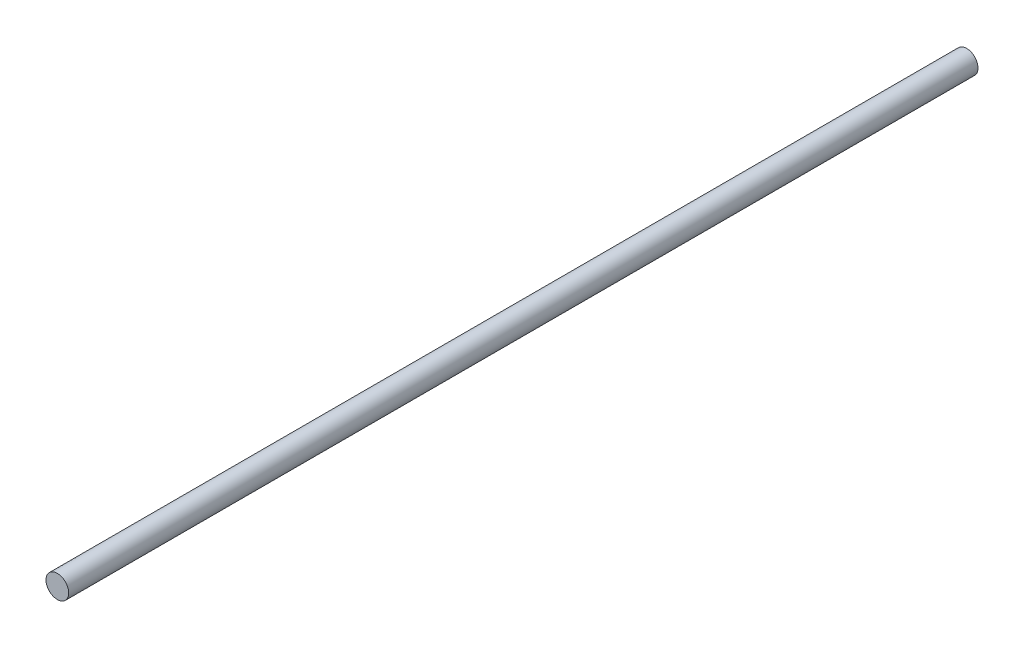
ISO-10303-21;
HEADER;
FILE_DESCRIPTION(('STEP AP214'),'2;1');
FILE_NAME('part.step','',(''),(''),'','','');
FILE_SCHEMA(('AUTOMOTIVE_DESIGN { 1 0 10303 214 1 1 1 1 }'));
ENDSEC;
DATA;
#1=APPLICATION_CONTEXT('core data for automotive mechanical design processes');
#2=APPLICATION_PROTOCOL_DEFINITION('international standard','automotive_design',2000,#1);
#3=PRODUCT_CONTEXT('',#1,'mechanical');
#4=PRODUCT('Part','Part','',(#3));
#5=PRODUCT_RELATED_PRODUCT_CATEGORY('part','',(#4));
#6=PRODUCT_DEFINITION_FORMATION('','',#4);
#7=PRODUCT_DEFINITION_CONTEXT('part definition',#1,'design');
#8=PRODUCT_DEFINITION('design','',#6,#7);
#9=PRODUCT_DEFINITION_SHAPE('','',#8);
#10=(LENGTH_UNIT() NAMED_UNIT(*) SI_UNIT(.MILLI.,.METRE.));
#11=(NAMED_UNIT(*) PLANE_ANGLE_UNIT() SI_UNIT($,.RADIAN.));
#12=(NAMED_UNIT(*) SI_UNIT($,.STERADIAN.) SOLID_ANGLE_UNIT());
#13=UNCERTAINTY_MEASURE_WITH_UNIT(LENGTH_MEASURE(1.E-05),#10,'distance_accuracy_value','');
#14=(GEOMETRIC_REPRESENTATION_CONTEXT(3) GLOBAL_UNCERTAINTY_ASSIGNED_CONTEXT((#13)) GLOBAL_UNIT_ASSIGNED_CONTEXT((#10,
#11,#12)) REPRESENTATION_CONTEXT('',''));
#15=CARTESIAN_POINT('',(0.,0.,0.));
#16=DIRECTION('',(0.,0.,1.));
#17=DIRECTION('',(1.,0.,0.));
#18=AXIS2_PLACEMENT_3D('',#15,#16,#17);
#19=CARTESIAN_POINT('',(0.,0.,254.));
#20=DIRECTION('',(0.,0.,-1.));
#21=DIRECTION('',(-1.,0.,0.));
#22=AXIS2_PLACEMENT_3D('',#19,#20,#21);
#23=CYLINDRICAL_SURFACE('',#22,3.175);
#24=CARTESIAN_POINT('',(0.,0.,254.));
#25=DIRECTION('',(0.,0.,1.));
#26=DIRECTION('',(1.,0.,0.));
#27=AXIS2_PLACEMENT_3D('',#24,#25,#26);
#28=CIRCLE('',#27,3.175);
#29=CARTESIAN_POINT('',(3.175,0.,254.));
#30=VERTEX_POINT('',#29);
#31=EDGE_CURVE('E10',#30,#30,#28,.T.);
#32=ORIENTED_EDGE('',*,*,#31,.F.);
#33=EDGE_LOOP('',(#32));
#34=FACE_BOUND('',#33,.T.);
#35=CARTESIAN_POINT('',(0.,0.,0.));
#36=DIRECTION('',(0.,0.,1.));
#37=DIRECTION('',(1.,0.,0.));
#38=AXIS2_PLACEMENT_3D('',#35,#36,#37);
#39=CIRCLE('',#38,3.175);
#40=CARTESIAN_POINT('',(3.175,0.,0.));
#41=VERTEX_POINT('',#40);
#42=EDGE_CURVE('E35',#41,#41,#39,.T.);
#43=ORIENTED_EDGE('',*,*,#42,.T.);
#44=EDGE_LOOP('',(#43));
#45=FACE_BOUND('',#44,.T.);
#46=ADVANCED_FACE('F32',(#34,#45),#23,.T.);
#47=CARTESIAN_POINT('',(0.,0.,254.));
#48=DIRECTION('',(0.,0.,1.));
#49=DIRECTION('',(1.,0.,0.));
#50=AXIS2_PLACEMENT_3D('',#47,#48,#49);
#51=PLANE('',#50);
#52=ORIENTED_EDGE('',*,*,#31,.T.);
#53=EDGE_LOOP('',(#52));
#54=FACE_BOUND('',#53,.T.);
#55=ADVANCED_FACE('F47',(#54),#51,.T.);
#56=CARTESIAN_POINT('',(0.,0.,0.));
#57=DIRECTION('',(0.,0.,1.));
#58=DIRECTION('',(1.,0.,0.));
#59=AXIS2_PLACEMENT_3D('',#56,#57,#58);
#60=PLANE('',#59);
#61=ORIENTED_EDGE('',*,*,#42,.F.);
#62=EDGE_LOOP('',(#61));
#63=FACE_BOUND('',#62,.T.);
#64=ADVANCED_FACE('F45',(#63),#60,.F.);
#65=CLOSED_SHELL('',(#46,#55,#64));
#66=MANIFOLD_SOLID_BREP('B2',#65);
#67=ADVANCED_BREP_SHAPE_REPRESENTATION('',(#18,#66),#14);
#68=SHAPE_DEFINITION_REPRESENTATION(#9,#67);
ENDSEC;
END-ISO-10303-21;
